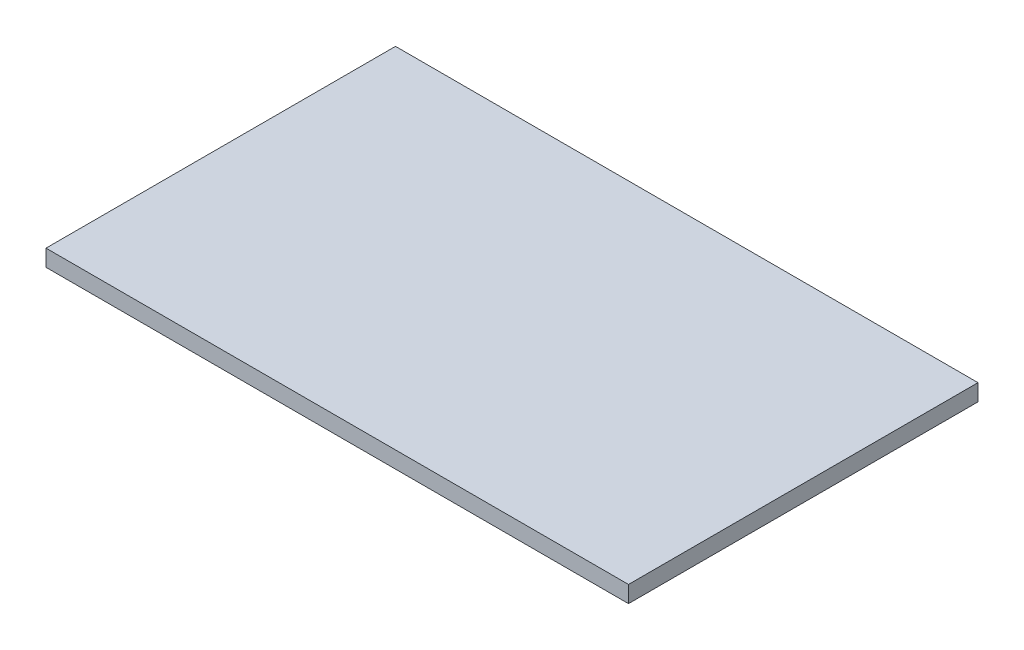
ISO-10303-21;
HEADER;
FILE_DESCRIPTION(('STEP AP214'),'2;1');
FILE_NAME('part.step','',(''),(''),'','','');
FILE_SCHEMA(('AUTOMOTIVE_DESIGN { 1 0 10303 214 1 1 1 1 }'));
ENDSEC;
DATA;
#1=APPLICATION_CONTEXT('core data for automotive mechanical design processes');
#2=APPLICATION_PROTOCOL_DEFINITION('international standard','automotive_design',2000,#1);
#3=PRODUCT_CONTEXT('',#1,'mechanical');
#4=PRODUCT('Part','Part','',(#3));
#5=PRODUCT_RELATED_PRODUCT_CATEGORY('part','',(#4));
#6=PRODUCT_DEFINITION_FORMATION('','',#4);
#7=PRODUCT_DEFINITION_CONTEXT('part definition',#1,'design');
#8=PRODUCT_DEFINITION('design','',#6,#7);
#9=PRODUCT_DEFINITION_SHAPE('','',#8);
#10=(LENGTH_UNIT() NAMED_UNIT(*) SI_UNIT(.MILLI.,.METRE.));
#11=(NAMED_UNIT(*) PLANE_ANGLE_UNIT() SI_UNIT($,.RADIAN.));
#12=(NAMED_UNIT(*) SI_UNIT($,.STERADIAN.) SOLID_ANGLE_UNIT());
#13=UNCERTAINTY_MEASURE_WITH_UNIT(LENGTH_MEASURE(1.E-05),#10,'distance_accuracy_value','');
#14=(GEOMETRIC_REPRESENTATION_CONTEXT(3) GLOBAL_UNCERTAINTY_ASSIGNED_CONTEXT((#13)) GLOBAL_UNIT_ASSIGNED_CONTEXT((#10,
#11,#12)) REPRESENTATION_CONTEXT('',''));
#15=CARTESIAN_POINT('',(0.,0.,0.));
#16=DIRECTION('',(0.,0.,1.));
#17=DIRECTION('',(1.,0.,0.));
#18=AXIS2_PLACEMENT_3D('',#15,#16,#17);
#19=CARTESIAN_POINT('',(0.,10.,0.));
#20=DIRECTION('',(1.,0.,0.));
#21=DIRECTION('',(0.,0.,-1.));
#22=AXIS2_PLACEMENT_3D('',#19,#20,#21);
#23=PLANE('',#22);
#24=DIRECTION('',(0.,0.,1.));
#25=VECTOR('',#24,1.);
#26=CARTESIAN_POINT('',(0.,0.,0.));
#27=LINE('',#26,#25);
#28=CARTESIAN_POINT('',(0.,0.,-210.));
#29=VERTEX_POINT('',#28);
#30=CARTESIAN_POINT('',(0.,0.,0.));
#31=VERTEX_POINT('',#30);
#32=EDGE_CURVE('E94',#29,#31,#27,.T.);
#33=ORIENTED_EDGE('',*,*,#32,.T.);
#34=DIRECTION('',(0.,-1.,0.));
#35=VECTOR('',#34,1.);
#36=CARTESIAN_POINT('',(0.,10.,0.));
#37=LINE('',#36,#35);
#38=CARTESIAN_POINT('',(0.,10.,0.));
#39=VERTEX_POINT('',#38);
#40=EDGE_CURVE('E11',#39,#31,#37,.T.);
#41=ORIENTED_EDGE('',*,*,#40,.F.);
#42=DIRECTION('',(0.,0.,1.));
#43=VECTOR('',#42,1.);
#44=CARTESIAN_POINT('',(0.,10.,0.));
#45=LINE('',#44,#43);
#46=CARTESIAN_POINT('',(0.,10.,-210.));
#47=VERTEX_POINT('',#46);
#48=EDGE_CURVE('E82',#47,#39,#45,.T.);
#49=ORIENTED_EDGE('',*,*,#48,.F.);
#50=DIRECTION('',(0.,-1.,0.));
#51=VECTOR('',#50,1.);
#52=CARTESIAN_POINT('',(0.,10.,-210.));
#53=LINE('',#52,#51);
#54=EDGE_CURVE('E90',#47,#29,#53,.T.);
#55=ORIENTED_EDGE('',*,*,#54,.T.);
#56=EDGE_LOOP('',(#33,#41,#49,#55));
#57=FACE_BOUND('',#56,.T.);
#58=ADVANCED_FACE('F31',(#57),#23,.F.);
#59=CARTESIAN_POINT('',(0.,10.,0.));
#60=DIRECTION('',(0.,0.,-1.));
#61=DIRECTION('',(-1.,0.,0.));
#62=AXIS2_PLACEMENT_3D('',#59,#60,#61);
#63=PLANE('',#62);
#64=DIRECTION('',(1.,0.,0.));
#65=VECTOR('',#64,1.);
#66=CARTESIAN_POINT('',(0.,0.,0.));
#67=LINE('',#66,#65);
#68=CARTESIAN_POINT('',(350.,0.,0.));
#69=VERTEX_POINT('',#68);
#70=EDGE_CURVE('E86',#31,#69,#67,.T.);
#71=ORIENTED_EDGE('',*,*,#70,.T.);
#72=DIRECTION('',(0.,-1.,0.));
#73=VECTOR('',#72,1.);
#74=CARTESIAN_POINT('',(350.,10.,0.));
#75=LINE('',#74,#73);
#76=CARTESIAN_POINT('',(350.,10.,0.));
#77=VERTEX_POINT('',#76);
#78=EDGE_CURVE('E39',#77,#69,#75,.T.);
#79=ORIENTED_EDGE('',*,*,#78,.F.);
#80=DIRECTION('',(1.,0.,0.));
#81=VECTOR('',#80,1.);
#82=CARTESIAN_POINT('',(0.,10.,0.));
#83=LINE('',#82,#81);
#84=EDGE_CURVE('E77',#39,#77,#83,.T.);
#85=ORIENTED_EDGE('',*,*,#84,.F.);
#86=ORIENTED_EDGE('',*,*,#40,.T.);
#87=EDGE_LOOP('',(#71,#79,#85,#86));
#88=FACE_BOUND('',#87,.T.);
#89=ADVANCED_FACE('F85',(#88),#63,.F.);
#90=CARTESIAN_POINT('',(350.,10.,0.));
#91=DIRECTION('',(-1.,0.,0.));
#92=DIRECTION('',(0.,0.,1.));
#93=AXIS2_PLACEMENT_3D('',#90,#91,#92);
#94=PLANE('',#93);
#95=DIRECTION('',(0.,0.,-1.));
#96=VECTOR('',#95,1.);
#97=CARTESIAN_POINT('',(350.,0.,0.));
#98=LINE('',#97,#96);
#99=CARTESIAN_POINT('',(350.,0.,-210.));
#100=VERTEX_POINT('',#99);
#101=EDGE_CURVE('E64',#69,#100,#98,.T.);
#102=ORIENTED_EDGE('',*,*,#101,.T.);
#103=DIRECTION('',(0.,-1.,0.));
#104=VECTOR('',#103,1.);
#105=CARTESIAN_POINT('',(350.,10.,-210.));
#106=LINE('',#105,#104);
#107=CARTESIAN_POINT('',(350.,10.,-210.));
#108=VERTEX_POINT('',#107);
#109=EDGE_CURVE('E87',#108,#100,#106,.T.);
#110=ORIENTED_EDGE('',*,*,#109,.F.);
#111=DIRECTION('',(0.,0.,-1.));
#112=VECTOR('',#111,1.);
#113=CARTESIAN_POINT('',(350.,10.,0.));
#114=LINE('',#113,#112);
#115=EDGE_CURVE('E80',#77,#108,#114,.T.);
#116=ORIENTED_EDGE('',*,*,#115,.F.);
#117=ORIENTED_EDGE('',*,*,#78,.T.);
#118=EDGE_LOOP('',(#102,#110,#116,#117));
#119=FACE_BOUND('',#118,.T.);
#120=ADVANCED_FACE('F88',(#119),#94,.F.);
#121=CARTESIAN_POINT('',(0.,10.,-210.));
#122=DIRECTION('',(0.,0.,1.));
#123=DIRECTION('',(1.,0.,0.));
#124=AXIS2_PLACEMENT_3D('',#121,#122,#123);
#125=PLANE('',#124);
#126=DIRECTION('',(-1.,0.,0.));
#127=VECTOR('',#126,1.);
#128=CARTESIAN_POINT('',(0.,0.,-210.));
#129=LINE('',#128,#127);
#130=EDGE_CURVE('E70',#100,#29,#129,.T.);
#131=ORIENTED_EDGE('',*,*,#130,.T.);
#132=ORIENTED_EDGE('',*,*,#54,.F.);
#133=DIRECTION('',(-1.,0.,0.));
#134=VECTOR('',#133,1.);
#135=CARTESIAN_POINT('',(0.,10.,-210.));
#136=LINE('',#135,#134);
#137=EDGE_CURVE('E47',#108,#47,#136,.T.);
#138=ORIENTED_EDGE('',*,*,#137,.F.);
#139=ORIENTED_EDGE('',*,*,#109,.T.);
#140=EDGE_LOOP('',(#131,#132,#138,#139));
#141=FACE_BOUND('',#140,.T.);
#142=ADVANCED_FACE('F101',(#141),#125,.F.);
#143=CARTESIAN_POINT('',(0.,10.,-210.));
#144=DIRECTION('',(0.,-1.,0.));
#145=DIRECTION('',(0.,0.,-1.));
#146=AXIS2_PLACEMENT_3D('',#143,#144,#145);
#147=PLANE('',#146);
#148=ORIENTED_EDGE('',*,*,#48,.T.);
#149=ORIENTED_EDGE('',*,*,#84,.T.);
#150=ORIENTED_EDGE('',*,*,#115,.T.);
#151=ORIENTED_EDGE('',*,*,#137,.T.);
#152=EDGE_LOOP('',(#148,#149,#150,#151));
#153=FACE_BOUND('',#152,.T.);
#154=ADVANCED_FACE('F78',(#153),#147,.F.);
#155=CARTESIAN_POINT('',(0.,0.,-210.));
#156=DIRECTION('',(0.,-1.,0.));
#157=DIRECTION('',(0.,0.,-1.));
#158=AXIS2_PLACEMENT_3D('',#155,#156,#157);
#159=PLANE('',#158);
#160=ORIENTED_EDGE('',*,*,#32,.F.);
#161=ORIENTED_EDGE('',*,*,#130,.F.);
#162=ORIENTED_EDGE('',*,*,#101,.F.);
#163=ORIENTED_EDGE('',*,*,#70,.F.);
#164=EDGE_LOOP('',(#160,#161,#162,#163));
#165=FACE_BOUND('',#164,.T.);
#166=ADVANCED_FACE('F104',(#165),#159,.T.);
#167=CLOSED_SHELL('',(#58,#89,#120,#142,#154,#166));
#168=MANIFOLD_SOLID_BREP('B2',#167);
#169=ADVANCED_BREP_SHAPE_REPRESENTATION('',(#18,#168),#14);
#170=SHAPE_DEFINITION_REPRESENTATION(#9,#169);
ENDSEC;
END-ISO-10303-21;
